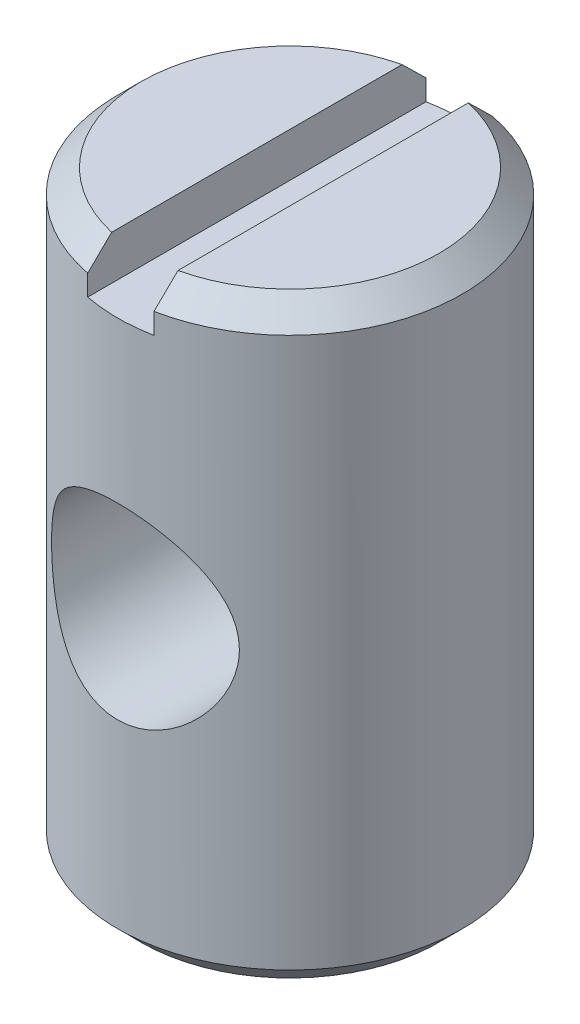
ISO-10303-21;
HEADER;
FILE_DESCRIPTION(('STEP AP214'),'2;1');
FILE_NAME('part.step','',(''),(''),'','','');
FILE_SCHEMA(('AUTOMOTIVE_DESIGN { 1 0 10303 214 1 1 1 1 }'));
ENDSEC;
DATA;
#1=APPLICATION_CONTEXT('core data for automotive mechanical design processes');
#2=APPLICATION_PROTOCOL_DEFINITION('international standard','automotive_design',2000,#1);
#3=PRODUCT_CONTEXT('',#1,'mechanical');
#4=PRODUCT('Part','Part','',(#3));
#5=PRODUCT_RELATED_PRODUCT_CATEGORY('part','',(#4));
#6=PRODUCT_DEFINITION_FORMATION('','',#4);
#7=PRODUCT_DEFINITION_CONTEXT('part definition',#1,'design');
#8=PRODUCT_DEFINITION('design','',#6,#7);
#9=PRODUCT_DEFINITION_SHAPE('','',#8);
#10=(LENGTH_UNIT() NAMED_UNIT(*) SI_UNIT(.MILLI.,.METRE.));
#11=(NAMED_UNIT(*) PLANE_ANGLE_UNIT() SI_UNIT($,.RADIAN.));
#12=(NAMED_UNIT(*) SI_UNIT($,.STERADIAN.) SOLID_ANGLE_UNIT());
#13=UNCERTAINTY_MEASURE_WITH_UNIT(LENGTH_MEASURE(1.E-05),#10,'distance_accuracy_value','');
#14=(GEOMETRIC_REPRESENTATION_CONTEXT(3) GLOBAL_UNCERTAINTY_ASSIGNED_CONTEXT((#13)) GLOBAL_UNIT_ASSIGNED_CONTEXT((#10,
#11,#12)) REPRESENTATION_CONTEXT('',''));
#15=CARTESIAN_POINT('',(0.,0.,0.));
#16=DIRECTION('',(0.,0.,1.));
#17=DIRECTION('',(1.,0.,0.));
#18=AXIS2_PLACEMENT_3D('',#15,#16,#17);
#19=CARTESIAN_POINT('',(0.,13.716,0.));
#20=DIRECTION('',(0.,1.,0.));
#21=DIRECTION('',(0.,0.,1.));
#22=AXIS2_PLACEMENT_3D('',#19,#20,#21);
#23=PLANE('',#22);
#24=DIRECTION('',(0.,0.,1.));
#25=VECTOR('',#24,1.);
#26=CARTESIAN_POINT('',(-0.762,13.716,-4.42144419335772));
#27=LINE('',#26,#25);
#28=CARTESIAN_POINT('',(-0.762,13.716,-3.33770695800352));
#29=VERTEX_POINT('',#28);
#30=CARTESIAN_POINT('',(-0.762000000000001,13.716,3.33770695800352));
#31=VERTEX_POINT('',#30);
#32=EDGE_CURVE('E175',#29,#31,#27,.T.);
#33=ORIENTED_EDGE('',*,*,#32,.F.);
#34=CARTESIAN_POINT('',(0.,13.716,0.));
#35=DIRECTION('',(0.,-1.,0.));
#36=DIRECTION('',(0.,0.,-1.));
#37=AXIS2_PLACEMENT_3D('',#34,#35,#36);
#38=CIRCLE('',#37,3.42358463273585);
#39=EDGE_CURVE('E177',#31,#29,#38,.T.);
#40=ORIENTED_EDGE('',*,*,#39,.F.);
#41=EDGE_LOOP('',(#33,#40));
#42=FACE_BOUND('',#41,.T.);
#43=ADVANCED_FACE('F36',(#42),#23,.T.);
#44=CARTESIAN_POINT('',(0.,13.1771846327359,0.));
#45=DIRECTION('',(0.,-1.,0.));
#46=DIRECTION('',(0.,0.,-1.));
#47=AXIS2_PLACEMENT_3D('',#44,#45,#46);
#48=CONICAL_SURFACE('',#47,3.9624,0.785398163397447);
#49=CARTESIAN_POINT('',(-0.762,13.1764846327358,-3.88915384241868));
#50=CARTESIAN_POINT('',(-0.762,13.2725234137536,-3.7912849415721));
#51=CARTESIAN_POINT('',(-0.762,13.3684979823827,-3.69335294588307));
#52=CARTESIAN_POINT('',(-0.762,13.5604084118547,-3.49718168791547));
#53=CARTESIAN_POINT('',(-0.762,13.6563440289932,-3.39894218726171));
#54=CARTESIAN_POINT('',(-0.762,13.8502900937675,-3.19989533596382));
#55=CARTESIAN_POINT('',(-0.762,13.9482952356119,-3.09908280950565));
#56=CARTESIAN_POINT('',(-0.762,14.1438570813751,-2.8972996653586));
#57=CARTESIAN_POINT('',(-0.762,14.2414142227925,-2.79632947111996));
#58=CARTESIAN_POINT('',(-0.762,14.5133697311457,-2.5137368754148));
#59=CARTESIAN_POINT('',(-0.762000000000001,14.6873234467839,-2.33168395017666));
#60=CARTESIAN_POINT('',(-0.762000000000001,14.9468511012226,-2.05629748590068));
#61=CARTESIAN_POINT('',(-0.762000000000001,15.0333679085639,-1.96385412397314));
#62=CARTESIAN_POINT('',(-0.762000000000001,15.2053779629451,-1.77813000147865));
#63=CARTESIAN_POINT('',(-0.762000000000001,15.2908718376705,-1.68484982314826));
#64=CARTESIAN_POINT('',(-0.762000000000001,15.4584876769228,-1.49901271998735));
#65=CARTESIAN_POINT('',(-0.762,15.5406423814312,-1.40648556184402));
#66=CARTESIAN_POINT('',(-0.762000000000001,15.6621455687927,-1.2659882807728));
#67=CARTESIAN_POINT('',(-0.762000000000001,15.7024084966591,-1.21881044932));
#68=CARTESIAN_POINT('',(-0.762000000000001,15.7820927608726,-1.1237508144509));
#69=CARTESIAN_POINT('',(-0.762000000000001,15.8215141426907,-1.07586904930722));
#70=CARTESIAN_POINT('',(-0.762000000000001,15.8987808161407,-0.979675108804961));
#71=CARTESIAN_POINT('',(-0.762000000000001,15.9366383504187,-0.931372808654795));
#72=CARTESIAN_POINT('',(-0.762000000000001,16.0107003383798,-0.833523176960325));
#73=CARTESIAN_POINT('',(-0.762000000000001,16.0469052157705,-0.783976169641534));
#74=CARTESIAN_POINT('',(-0.762000000000001,16.1166969489382,-0.683350700041306));
#75=CARTESIAN_POINT('',(-0.762000000000001,16.1502936183965,-0.632279090908778));
#76=CARTESIAN_POINT('',(-0.762000000000001,16.2135850348493,-0.527790782899455));
#77=CARTESIAN_POINT('',(-0.762000000000001,16.2432860456415,-0.474378037527284));
#78=CARTESIAN_POINT('',(-0.762000000000001,16.2754184608974,-0.407728077607535));
#79=CARTESIAN_POINT('',(-0.762000000000001,16.2809117834785,-0.395962527727781));
#80=CARTESIAN_POINT('',(-0.762000000000001,16.2915727529747,-0.372280120515825));
#81=CARTESIAN_POINT('',(-0.762000000000001,16.2967402884964,-0.360363213086689));
#82=CARTESIAN_POINT('',(-0.762000000000001,16.3116981051018,-0.32438809731012));
#83=CARTESIAN_POINT('',(-0.762000000000001,16.3209463304274,-0.300099899165241));
#84=CARTESIAN_POINT('',(-0.762000000000001,16.337548018884,-0.251272305994814));
#85=CARTESIAN_POINT('',(-0.762000000000001,16.3449270895583,-0.226741705767929));
#86=CARTESIAN_POINT('',(-0.762000000000001,16.3576333609885,-0.177138669407671));
#87=CARTESIAN_POINT('',(-0.762000000000001,16.3629599686638,-0.152066078867573));
#88=CARTESIAN_POINT('',(-0.762000000000001,16.3713470726516,-0.100962699246851));
#89=CARTESIAN_POINT('',(-0.762000000000001,16.3743544304069,-0.0749230078445896));
#90=CARTESIAN_POINT('',(-0.762000000000001,16.3776926558913,-0.022678992930157));
#91=CARTESIAN_POINT('',(-0.762000000000001,16.3780245309172,0.00352526490513808));
#92=CARTESIAN_POINT('',(-0.762000000000001,16.3759889298047,0.0558399532298979));
#93=CARTESIAN_POINT('',(-0.762000000000001,16.373620096976,0.0819503299462617));
#94=CARTESIAN_POINT('',(-0.762000000000001,16.366350506585,0.133819273652817));
#95=CARTESIAN_POINT('',(-0.762000000000001,16.3614486610262,0.159577684580384));
#96=CARTESIAN_POINT('',(-0.762000000000001,16.3479300988026,0.21685792012831));
#97=CARTESIAN_POINT('',(-0.762000000000001,16.3386949909186,0.248232486673333));
#98=CARTESIAN_POINT('',(-0.762000000000001,16.3174466249232,0.310017236700923));
#99=CARTESIAN_POINT('',(-0.762000000000001,16.3054321505824,0.340426991345254));
#100=CARTESIAN_POINT('',(-0.762000000000001,16.2791708285319,0.400504141876659));
#101=CARTESIAN_POINT('',(-0.762000000000001,16.2649091248219,0.430164953823593));
#102=CARTESIAN_POINT('',(-0.762000000000001,16.2347305423086,0.488611187050659));
#103=CARTESIAN_POINT('',(-0.762000000000001,16.2188141162323,0.51739684499919));
#104=CARTESIAN_POINT('',(-0.762000000000001,16.1678870204156,0.604877315343752));
#105=CARTESIAN_POINT('',(-0.762000000000001,16.130793651709,0.662352976226465));
#106=CARTESIAN_POINT('',(-0.762000000000001,16.0534027157473,0.775122384746781));
#107=CARTESIAN_POINT('',(-0.762000000000001,16.0131020126512,0.83041391592934));
#108=CARTESIAN_POINT('',(-0.762000000000001,15.9303688707398,0.93958917057718));
#109=CARTESIAN_POINT('',(-0.762000000000001,15.8879313262341,0.993469004298655));
#110=CARTESIAN_POINT('',(-0.762000000000001,15.8016939267619,1.10013129032849));
#111=CARTESIAN_POINT('',(-0.762000000000001,15.7578938729972,1.1529135806065));
#112=CARTESIAN_POINT('',(-0.762000000000001,15.6691464719561,1.25790855858688));
#113=CARTESIAN_POINT('',(-0.762000000000001,15.6241948608309,1.31011763088206));
#114=CARTESIAN_POINT('',(-0.762000000000001,15.5335954279645,1.41392912275435));
#115=CARTESIAN_POINT('',(-0.762000000000001,15.4879475849589,1.46553152371674));
#116=CARTESIAN_POINT('',(-0.762000000000001,15.3503935476947,1.61947598825091));
#117=CARTESIAN_POINT('',(-0.762000000000001,15.2577231601534,1.72113436354037));
#118=CARTESIAN_POINT('',(-0.762000000000001,15.082594065033,1.91094607118329));
#119=CARTESIAN_POINT('',(-0.762000000000001,15.000274587501,1.9992286930172));
#120=CARTESIAN_POINT('',(-0.762000000000001,14.8349863206549,2.17518689343137));
#121=CARTESIAN_POINT('',(-0.762000000000001,14.7520175193008,2.2628624606985));
#122=CARTESIAN_POINT('',(-0.762000000000001,14.5023198966647,2.52536452959782));
#123=CARTESIAN_POINT('',(-0.762000000000001,14.334912914799,2.69954505715497));
#124=CARTESIAN_POINT('',(-0.762000000000001,14.002593709442,3.04334452351151));
#125=CARTESIAN_POINT('',(-0.762000000000001,13.8377017703164,3.21298313678113));
#126=CARTESIAN_POINT('',(-0.762000000000001,13.5074190455435,3.5515162569994));
#127=CARTESIAN_POINT('',(-0.762000000000001,13.3420287493158,3.72041124114226));
#128=CARTESIAN_POINT('',(-0.762000000000001,13.1764846327358,3.88915384241868));
#129=B_SPLINE_CURVE_WITH_KNOTS('',3,(#49,#50,#51,#52,#53,#54,#55,#56,#57,#58,#59,#60,#61,#62,
#63,#64,#65,#66,#67,#68,#69,#70,#71,#72,#73,#74,#75,#76,#77,#78,#79,#80,#81,#82,#83,#84,#85,#86,
#87,#88,#89,#90,#91,#92,#93,#94,#95,#96,#97,#98,#99,#100,#101,#102,#103,#104,#105,#106,#107,
#108,#109,#110,#111,#112,#113,#114,#115,#116,#117,#118,#119,#120,#121,#122,#123,#124,#125,#126,
#127,#128),.UNSPECIFIED.,.F.,.F.,(4,2,2,2,2,2,2,2,2,2,2,2,2,2,2,2,2,2,2,2,2,2,2,2,2,2,2,2,2,2,2,
2,2,2,2,2,2,2,2,4),(0.,0.411358663586705,0.823295104655468,1.24509236639245,1.66629478319138,
2.42167845699793,2.80151363749427,3.18110237335076,3.5522808365199,3.73834307928575,
3.92439524305245,4.10848390822819,4.29252510864786,4.47583639536256,4.6588492265476,
4.69779924373798,4.73676250733111,4.8146703766901,4.89144484825009,4.96824148798541,
5.04674932484981,5.12522760278832,5.20374532136509,5.28229679346273,5.3802428750695,
5.47823189847825,5.57689821424319,5.67553760589328,5.88054052526118,6.08574640011215,
6.29146829178851,6.49722034160438,6.70389499445958,6.91057597232372,7.32323019523743,
7.68534994272209,8.04747642063783,8.77222689147921,9.48194344092483,10.1911064123325),.UNSPECIFIED.);
#130=CARTESIAN_POINT('',(-0.762,13.1771846327359,-3.88844053059835));
#131=VERTEX_POINT('',#130);
#132=EDGE_CURVE('E179',#131,#29,#129,.T.);
#133=ORIENTED_EDGE('',*,*,#132,.F.);
#134=CARTESIAN_POINT('',(0.,13.1771846327359,0.));
#135=DIRECTION('',(0.,-1.,0.));
#136=DIRECTION('',(0.,0.,-1.));
#137=AXIS2_PLACEMENT_3D('',#134,#135,#136);
#138=CIRCLE('',#137,3.9624);
#139=CARTESIAN_POINT('',(-0.762000000000001,13.1771846327359,3.88844053059835));
#140=VERTEX_POINT('',#139);
#141=EDGE_CURVE('E112',#140,#131,#138,.T.);
#142=ORIENTED_EDGE('',*,*,#141,.F.);
#143=EDGE_CURVE('E147',#31,#140,#129,.T.);
#144=ORIENTED_EDGE('',*,*,#143,.F.);
#145=ORIENTED_EDGE('',*,*,#39,.T.);
#146=EDGE_LOOP('',(#133,#142,#144,#145));
#147=FACE_BOUND('',#146,.T.);
#148=ADVANCED_FACE('F157',(#147),#48,.T.);
#149=DIRECTION('',(0.,0.,-1.));
#150=VECTOR('',#149,1.);
#151=CARTESIAN_POINT('',(0.762,13.716,-4.42144419335772));
#152=LINE('',#151,#150);
#153=CARTESIAN_POINT('',(0.762000000000001,13.716,3.33770695800352));
#154=VERTEX_POINT('',#153);
#155=CARTESIAN_POINT('',(0.762,13.716,-3.33770695800352));
#156=VERTEX_POINT('',#155);
#157=EDGE_CURVE('E106',#154,#156,#152,.T.);
#158=ORIENTED_EDGE('',*,*,#157,.F.);
#159=EDGE_CURVE('E180',#156,#154,#38,.T.);
#160=ORIENTED_EDGE('',*,*,#159,.F.);
#161=EDGE_LOOP('',(#158,#160));
#162=FACE_BOUND('',#161,.T.);
#163=ADVANCED_FACE('F38',(#162),#23,.T.);
#164=CARTESIAN_POINT('',(0.762000000000001,13.1764846327358,3.88915384241868));
#165=CARTESIAN_POINT('',(0.762000000000001,13.2725234137536,3.7912849415721));
#166=CARTESIAN_POINT('',(0.762000000000001,13.3684979823827,3.69335294588307));
#167=CARTESIAN_POINT('',(0.762000000000001,13.5604084118547,3.49718168791547));
#168=CARTESIAN_POINT('',(0.762000000000001,13.6563440289932,3.39894218726171));
#169=CARTESIAN_POINT('',(0.762000000000001,13.8502900937675,3.19989533596382));
#170=CARTESIAN_POINT('',(0.762000000000001,13.9482952356119,3.09908280950565));
#171=CARTESIAN_POINT('',(0.762000000000001,14.1438570813751,2.8972996653586));
#172=CARTESIAN_POINT('',(0.762000000000001,14.2414142227925,2.79632947111996));
#173=CARTESIAN_POINT('',(0.762000000000001,14.5133697311457,2.5137368754148));
#174=CARTESIAN_POINT('',(0.762000000000001,14.6873234467839,2.33168395017666));
#175=CARTESIAN_POINT('',(0.762000000000001,14.9468511012226,2.05629748590068));
#176=CARTESIAN_POINT('',(0.762000000000001,15.0333679085639,1.96385412397314));
#177=CARTESIAN_POINT('',(0.762000000000001,15.2053779629451,1.77813000147865));
#178=CARTESIAN_POINT('',(0.762000000000001,15.2908718376705,1.68484982314826));
#179=CARTESIAN_POINT('',(0.762000000000001,15.4584876769228,1.49901271998735));
#180=CARTESIAN_POINT('',(0.762000000000001,15.5406423814312,1.40648556184402));
#181=CARTESIAN_POINT('',(0.762000000000001,15.6621455687927,1.2659882807728));
#182=CARTESIAN_POINT('',(0.762000000000001,15.7024084966591,1.21881044932));
#183=CARTESIAN_POINT('',(0.762000000000001,15.7820927608726,1.1237508144509));
#184=CARTESIAN_POINT('',(0.762000000000001,15.8215141426907,1.07586904930722));
#185=CARTESIAN_POINT('',(0.762000000000001,15.8987808161407,0.979675108804963));
#186=CARTESIAN_POINT('',(0.762000000000001,15.9366383504187,0.931372808654796));
#187=CARTESIAN_POINT('',(0.762000000000001,16.0107003383798,0.833523176960326));
#188=CARTESIAN_POINT('',(0.762000000000001,16.0469052157705,0.783976169641535));
#189=CARTESIAN_POINT('',(0.762000000000001,16.1166969489382,0.683350700041306));
#190=CARTESIAN_POINT('',(0.762000000000001,16.1502936183965,0.632279090908778));
#191=CARTESIAN_POINT('',(0.762000000000001,16.2135850348493,0.527790782899455));
#192=CARTESIAN_POINT('',(0.762000000000001,16.2432860456415,0.474378037527284));
#193=CARTESIAN_POINT('',(0.762000000000001,16.2754184608974,0.407728077607535));
#194=CARTESIAN_POINT('',(0.762000000000001,16.2809117834785,0.395962527727781));
#195=CARTESIAN_POINT('',(0.762000000000001,16.2915727529747,0.372280120515825));
#196=CARTESIAN_POINT('',(0.762000000000001,16.2967402884964,0.360363213086689));
#197=CARTESIAN_POINT('',(0.762000000000001,16.3116981051018,0.324388097310119));
#198=CARTESIAN_POINT('',(0.762000000000001,16.3209463304274,0.30009989916524));
#199=CARTESIAN_POINT('',(0.762000000000001,16.337548018884,0.251272305994814));
#200=CARTESIAN_POINT('',(0.762000000000001,16.3449270895583,0.226741705767929));
#201=CARTESIAN_POINT('',(0.762000000000001,16.3576333609885,0.177138669407671));
#202=CARTESIAN_POINT('',(0.762000000000001,16.3629599686638,0.152066078867573));
#203=CARTESIAN_POINT('',(0.762000000000001,16.3713470726516,0.100962699246851));
#204=CARTESIAN_POINT('',(0.762000000000001,16.3743544304069,0.0749230078445894));
#205=CARTESIAN_POINT('',(0.762000000000001,16.3776926558913,0.0226789929301568));
#206=CARTESIAN_POINT('',(0.762000000000001,16.3780245309172,-0.00352526490513822));
#207=CARTESIAN_POINT('',(0.762000000000001,16.3759889298047,-0.0558399532298978));
#208=CARTESIAN_POINT('',(0.762000000000001,16.373620096976,-0.0819503299462613));
#209=CARTESIAN_POINT('',(0.762000000000001,16.366350506585,-0.133819273652817));
#210=CARTESIAN_POINT('',(0.762000000000001,16.3614486610262,-0.159577684580384));
#211=CARTESIAN_POINT('',(0.762000000000001,16.3479300988026,-0.21685792012831));
#212=CARTESIAN_POINT('',(0.762000000000001,16.3386949909186,-0.248232486673332));
#213=CARTESIAN_POINT('',(0.762000000000001,16.3174466249232,-0.310017236700923));
#214=CARTESIAN_POINT('',(0.762000000000001,16.3054321505824,-0.340426991345254));
#215=CARTESIAN_POINT('',(0.762000000000001,16.2791708285319,-0.40050414187666));
#216=CARTESIAN_POINT('',(0.762000000000001,16.2649091248219,-0.430164953823594));
#217=CARTESIAN_POINT('',(0.762000000000001,16.2347305423086,-0.488611187050659));
#218=CARTESIAN_POINT('',(0.762000000000001,16.2188141162323,-0.517396844999189));
#219=CARTESIAN_POINT('',(0.762000000000001,16.1678870204156,-0.604877315343751));
#220=CARTESIAN_POINT('',(0.762000000000001,16.130793651709,-0.662352976226462));
#221=CARTESIAN_POINT('',(0.762000000000001,16.0534027157473,-0.775122384746778));
#222=CARTESIAN_POINT('',(0.762000000000001,16.0131020126512,-0.830413915929337));
#223=CARTESIAN_POINT('',(0.762000000000001,15.9303688707398,-0.939589170577178));
#224=CARTESIAN_POINT('',(0.762000000000001,15.8879313262341,-0.993469004298654));
#225=CARTESIAN_POINT('',(0.762000000000001,15.8016939267619,-1.10013129032849));
#226=CARTESIAN_POINT('',(0.762000000000001,15.7578938729973,-1.1529135806065));
#227=CARTESIAN_POINT('',(0.762000000000001,15.6691464719562,-1.25790855858688));
#228=CARTESIAN_POINT('',(0.762000000000001,15.6241948608309,-1.31011763088206));
#229=CARTESIAN_POINT('',(0.762000000000001,15.5335954279645,-1.41392912275435));
#230=CARTESIAN_POINT('',(0.762000000000001,15.4879475849589,-1.46553152371674));
#231=CARTESIAN_POINT('',(0.762000000000001,15.3503935476947,-1.61947598825091));
#232=CARTESIAN_POINT('',(0.762000000000001,15.2577231601534,-1.72113436354037));
#233=CARTESIAN_POINT('',(0.762000000000001,15.082594065033,-1.91094607118328));
#234=CARTESIAN_POINT('',(0.762000000000001,15.000274587501,-1.9992286930172));
#235=CARTESIAN_POINT('',(0.762000000000001,14.8349863206549,-2.17518689343137));
#236=CARTESIAN_POINT('',(0.762,14.7520175193008,-2.2628624606985));
#237=CARTESIAN_POINT('',(0.762,14.5023198966647,-2.52536452959782));
#238=CARTESIAN_POINT('',(0.762,14.334912914799,-2.69954505715497));
#239=CARTESIAN_POINT('',(0.762,14.002593709442,-3.04334452351151));
#240=CARTESIAN_POINT('',(0.762,13.8377017703164,-3.21298313678113));
#241=CARTESIAN_POINT('',(0.762,13.5074190455435,-3.55151625699939));
#242=CARTESIAN_POINT('',(0.762,13.3420287493158,-3.72041124114226));
#243=CARTESIAN_POINT('',(0.762,13.1764846327358,-3.88915384241868));
#244=B_SPLINE_CURVE_WITH_KNOTS('',3,(#164,#165,#166,#167,#168,#169,#170,#171,#172,#173,#174,
#175,#176,#177,#178,#179,#180,#181,#182,#183,#184,#185,#186,#187,#188,#189,#190,#191,#192,#193,
#194,#195,#196,#197,#198,#199,#200,#201,#202,#203,#204,#205,#206,#207,#208,#209,#210,#211,#212,
#213,#214,#215,#216,#217,#218,#219,#220,#221,#222,#223,#224,#225,#226,#227,#228,#229,#230,#231,
#232,#233,#234,#235,#236,#237,#238,#239,#240,#241,#242,#243),.UNSPECIFIED.,.F.,.F.,(4,2,2,2,2,2,
2,2,2,2,2,2,2,2,2,2,2,2,2,2,2,2,2,2,2,2,2,2,2,2,2,2,2,2,2,2,2,2,2,4),(0.,0.411358663586705,
0.823295104655469,1.24509236639245,1.66629478319138,2.42167845699794,2.80151363749427,
3.18110237335076,3.5522808365199,3.73834307928575,3.92439524305245,4.10848390822819,
4.29252510864786,4.47583639536256,4.6588492265476,4.69779924373798,4.73676250733111,
4.8146703766901,4.89144484825009,4.96824148798542,5.04674932484981,5.12522760278832,
5.20374532136508,5.28229679346273,5.3802428750695,5.47823189847825,5.57689821424319,
5.67553760589328,5.88054052526118,6.08574640011215,6.29146829178851,6.49722034160438,
6.70389499445958,6.91057597232372,7.32323019523743,7.68534994272209,8.04747642063783,
8.77222689147921,9.48194344092483,10.1911064123325),.UNSPECIFIED.);
#245=CARTESIAN_POINT('',(0.762000000000001,13.1771846327359,3.88844053059835));
#246=VERTEX_POINT('',#245);
#247=EDGE_CURVE('E145',#246,#154,#244,.T.);
#248=ORIENTED_EDGE('',*,*,#247,.F.);
#249=CARTESIAN_POINT('',(0.762,13.1771846327359,-3.88844053059835));
#250=VERTEX_POINT('',#249);
#251=EDGE_CURVE('E181',#250,#246,#138,.T.);
#252=ORIENTED_EDGE('',*,*,#251,.F.);
#253=EDGE_CURVE('E138',#156,#250,#244,.T.);
#254=ORIENTED_EDGE('',*,*,#253,.F.);
#255=ORIENTED_EDGE('',*,*,#159,.T.);
#256=EDGE_LOOP('',(#248,#252,#254,#255));
#257=FACE_BOUND('',#256,.T.);
#258=ADVANCED_FACE('F153',(#257),#48,.T.);
#259=CARTESIAN_POINT('',(0.,0.,0.));
#260=DIRECTION('',(0.,-1.,0.));
#261=DIRECTION('',(0.,0.,-1.));
#262=AXIS2_PLACEMENT_3D('',#259,#260,#261);
#263=CYLINDRICAL_SURFACE('',#262,3.9624);
#264=CARTESIAN_POINT('',(0.,9.017,-3.9624));
#265=CARTESIAN_POINT('',(0.112242546144472,9.01699131432553,-3.96239240943324));
#266=CARTESIAN_POINT('',(0.2245861444206,9.00819547685096,-3.95758138257743));
#267=CARTESIAN_POINT('',(0.445871149462538,8.9734359092762,-3.93880653812431));
#268=CARTESIAN_POINT('',(0.554807487465608,8.94744776727653,-3.9248297059548));
#269=CARTESIAN_POINT('',(0.765760589702777,8.87966207593217,-3.88916768015029));
#270=CARTESIAN_POINT('',(0.867803719866992,8.83792932203938,-3.86751410116477));
#271=CARTESIAN_POINT('',(1.06324124091637,8.7402189610099,-3.81841592720982));
#272=CARTESIAN_POINT('',(1.15663536109644,8.68424090821542,-3.79097115106997));
#273=CARTESIAN_POINT('',(1.33926109331299,8.55534807837654,-3.73053107967804));
#274=CARTESIAN_POINT('',(1.4277783309556,8.48154074004449,-3.69728531100643));
#275=CARTESIAN_POINT('',(1.59185360919563,8.32103454092115,-3.62967026516628));
#276=CARTESIAN_POINT('',(1.66739977223414,8.23432399889108,-3.59529999221315));
#277=CARTESIAN_POINT('',(1.81072292527419,8.04056458270405,-3.52545629246179));
#278=CARTESIAN_POINT('',(1.87705256916511,7.93236148520075,-3.49019502104813));
#279=CARTESIAN_POINT('',(1.99032652537086,7.7041861049436,-3.42687328274529));
#280=CARTESIAN_POINT('',(2.03728607244864,7.58422316368693,-3.39880716340304));
#281=CARTESIAN_POINT('',(2.09023335870458,7.40196286104769,-3.36629195317351));
#282=CARTESIAN_POINT('',(2.10473796862245,7.34285738933262,-3.35721465723211));
#283=CARTESIAN_POINT('',(2.1287471100664,7.22327677499569,-3.34204344560993));
#284=CARTESIAN_POINT('',(2.13825455766308,7.16280245270046,-3.33594779015126));
#285=CARTESIAN_POINT('',(2.15209471111484,7.04107781543585,-3.32703639034022));
#286=CARTESIAN_POINT('',(2.15643214744841,6.97982826174069,-3.32421764772281));
#287=CARTESIAN_POINT('',(2.15987303314584,6.85714110018195,-3.32198161455269));
#288=CARTESIAN_POINT('',(2.15897717220029,6.79570351816502,-3.32256387578534));
#289=CARTESIAN_POINT('',(2.14948390224229,6.63027925062869,-3.32872564688208));
#290=CARTESIAN_POINT('',(2.13592974221056,6.52664391729863,-3.33752093203394));
#291=CARTESIAN_POINT('',(2.09437060990876,6.32351374121958,-3.36374864713965));
#292=CARTESIAN_POINT('',(2.06635930570396,6.22402073337575,-3.38118486151123));
#293=CARTESIAN_POINT('',(1.99630578368146,6.02914591247129,-3.42302029235244));
#294=CARTESIAN_POINT('',(1.9539700274707,5.93390165133409,-3.44756348874107));
#295=CARTESIAN_POINT('',(1.85671578412842,5.75138476515411,-3.50089883637572));
#296=CARTESIAN_POINT('',(1.80179181287756,5.66411563776436,-3.52969283755482));
#297=CARTESIAN_POINT('',(1.67107216566348,5.4858388218009,-3.59363340614745));
#298=CARTESIAN_POINT('',(1.59336329081294,5.39633410221413,-3.62907440518571));
#299=CARTESIAN_POINT('',(1.4240627416305,5.23093409510115,-3.69878989494452));
#300=CARTESIAN_POINT('',(1.33246196614071,5.15504780125486,-3.73306360276487));
#301=CARTESIAN_POINT('',(1.13058518822213,5.01432277184015,-3.79925980167088));
#302=CARTESIAN_POINT('',(1.01948444705296,4.95051617632702,-3.83088679501183));
#303=CARTESIAN_POINT('',(0.785984643158287,4.84306041007964,-3.88550721342125));
#304=CARTESIAN_POINT('',(0.663596165652958,4.79939258001855,-3.90850862670723));
#305=CARTESIAN_POINT('',(0.423055699238972,4.73755787954535,-3.94144543422628));
#306=CARTESIAN_POINT('',(0.305552757042455,4.71741175173818,-3.95238962103185));
#307=CARTESIAN_POINT('',(0.0683528323712017,4.69680737992057,-3.96358471508688));
#308=CARTESIAN_POINT('',(-0.0513427444618571,4.69633693574968,-3.96384224873215));
#309=CARTESIAN_POINT('',(-0.277303885499177,4.71417350801976,-3.95414792248497));
#310=CARTESIAN_POINT('',(-0.383759968417556,4.73069078749383,-3.94516913500534));
#311=CARTESIAN_POINT('',(-0.59211937733196,4.77903015575992,-3.91931524375721));
#312=CARTESIAN_POINT('',(-0.694022237665041,4.81085380605321,-3.90243933435728));
#313=CARTESIAN_POINT('',(-0.893214148599867,4.88945060060717,-3.86178256139163));
#314=CARTESIAN_POINT('',(-0.990340638949996,4.9365544121047,-3.83785014646261));
#315=CARTESIAN_POINT('',(-1.17557314087734,5.04394809657074,-3.78522485969292));
#316=CARTESIAN_POINT('',(-1.2636757653204,5.10424289437765,-3.75653021084661));
#317=CARTESIAN_POINT('',(-1.43874340776188,5.24393990056086,-3.69326710700851));
#318=CARTESIAN_POINT('',(-1.52450347260248,5.32471824075665,-3.6584000453044));
#319=CARTESIAN_POINT('',(-1.68189635719445,5.49920220257583,-3.58876872803737));
#320=CARTESIAN_POINT('',(-1.75351494590016,5.59292068680834,-3.5540046103654));
#321=CARTESIAN_POINT('',(-1.88580605517688,5.79917249266045,-3.48572736627169));
#322=CARTESIAN_POINT('',(-1.94526682366895,5.9125870820473,-3.45250002205897));
#323=CARTESIAN_POINT('',(-2.04367768153916,6.15009931066941,-3.39518401420682));
#324=CARTESIAN_POINT('',(-2.08265750914634,6.27418115455534,-3.37108211476231));
#325=CARTESIAN_POINT('',(-2.13511141177764,6.51677161923811,-3.33808228742221));
#326=CARTESIAN_POINT('',(-2.15070027854392,6.63464560113979,-3.32793195171913));
#327=CARTESIAN_POINT('',(-2.16220790011491,6.87171879216694,-3.32047222173503));
#328=CARTESIAN_POINT('',(-2.1581423817353,6.99091686561712,-3.32315256073817));
#329=CARTESIAN_POINT('',(-2.13250993124946,7.21053018070471,-3.33963764589562));
#330=CARTESIAN_POINT('',(-2.11331535675371,7.31135374234509,-3.3519327886451));
#331=CARTESIAN_POINT('',(-2.06130270467544,7.50813529016438,-3.38416542002782));
#332=CARTESIAN_POINT('',(-2.02847921651105,7.6040913269742,-3.40410594358178));
#333=CARTESIAN_POINT('',(-1.9479363188434,7.79514477427011,-3.45086166600508));
#334=CARTESIAN_POINT('',(-1.8994155315669,7.88981535796608,-3.47802807065245));
#335=CARTESIAN_POINT('',(-1.7896280720848,8.07030614159139,-3.53577348996969));
#336=CARTESIAN_POINT('',(-1.72835458853531,8.15612157510789,-3.56635432425836));
#337=CARTESIAN_POINT('',(-1.58386235829169,8.33018506937177,-3.63307602759659));
#338=CARTESIAN_POINT('',(-1.49872012710322,8.41679489888095,-3.66935146494798));
#339=CARTESIAN_POINT('',(-1.31447562970143,8.5750337993025,-3.7393180984474));
#340=CARTESIAN_POINT('',(-1.21536373855542,8.64665245620829,-3.77300748790939));
#341=CARTESIAN_POINT('',(-1.00160593652987,8.77477340873364,-3.83537658744772));
#342=CARTESIAN_POINT('',(-0.886570024398929,8.83073053566536,-3.86386581287025));
#343=CARTESIAN_POINT('',(-0.706920647946546,8.89899483022839,-3.8993112018783));
#344=CARTESIAN_POINT('',(-0.645892122268114,8.91913060185105,-3.9099075814892));
#345=CARTESIAN_POINT('',(-0.521911048927872,8.95395488702047,-3.92837608301541));
#346=CARTESIAN_POINT('',(-0.458959546594552,8.96864630501982,-3.93624965734205));
#347=CARTESIAN_POINT('',(-0.330391387377316,8.99259230002858,-3.9491407445406));
#348=CARTESIAN_POINT('',(-0.264746554566714,9.00172955020073,-3.95409655849612));
#349=CARTESIAN_POINT('',(-0.132746263918452,9.01393595530517,-3.96072842373921));
#350=CARTESIAN_POINT('',(-0.0663908092778158,9.01700513752563,-3.96240448977583));
#351=CARTESIAN_POINT('',(0.,9.017,-3.9624));
#352=B_SPLINE_CURVE_WITH_KNOTS('',3,(#264,#265,#266,#267,#268,#269,#270,#271,#272,#273,#274,
#275,#276,#277,#278,#279,#280,#281,#282,#283,#284,#285,#286,#287,#288,#289,#290,#291,#292,#293,
#294,#295,#296,#297,#298,#299,#300,#301,#302,#303,#304,#305,#306,#307,#308,#309,#310,#311,#312,
#313,#314,#315,#316,#317,#318,#319,#320,#321,#322,#323,#324,#325,#326,#327,#328,#329,#330,#331,
#332,#333,#334,#335,#336,#337,#338,#339,#340,#341,#342,#343,#344,#345,#346,#347,#348,#349,#350,
#351),.UNSPECIFIED.,.T.,.F.,(4,2,2,2,2,2,2,2,2,2,2,2,2,2,2,2,2,2,2,2,2,2,2,2,2,2,2,2,2,2,2,2,2,
2,2,2,2,2,2,2,2,2,2,4),(0.,0.336470062550721,0.673418918059839,1.00899595693735,
1.34458349548263,1.70298042669212,2.06170381019734,2.4549494770086,2.8478852599393,
3.03224292624814,3.21649289173038,3.40057414167938,3.58463113230677,3.89766046926167,
4.21082702318238,4.53084448687431,4.85100163369022,5.22058777041753,5.59041709270351,
5.98416898724702,6.37755531918575,6.73468761384255,7.09159846074615,7.41440942379479,
7.7372533258523,8.06761039981068,8.3980910232979,8.76514572314338,9.13256794079159,
9.5273421855647,9.9215416248037,10.2773389145065,10.6328515536457,10.9416024165485,
11.2504759687194,11.5786140524989,11.906927849992,12.2854952827603,12.6643248307817,
13.0550477301602,13.2501845519639,13.4452171218424,13.6442380900501,13.8432581632561),.UNSPECIFIED.);
#353=CARTESIAN_POINT('',(0.,9.017,-3.9624));
#354=VERTEX_POINT('',#353);
#355=EDGE_CURVE('E11',#354,#354,#352,.T.);
#356=ORIENTED_EDGE('',*,*,#355,.F.);
#357=EDGE_LOOP('',(#356));
#358=FACE_BOUND('',#357,.T.);
#359=CARTESIAN_POINT('',(2.159,6.858,3.32254913582929));
#360=CARTESIAN_POINT('',(2.15899009982912,6.96884509964673,3.32256226553342));
#361=CARTESIAN_POINT('',(2.15040371898715,7.0797970867572,3.32818422001346));
#362=CARTESIAN_POINT('',(2.11655525795951,7.29815854031264,3.3498032033459));
#363=CARTESIAN_POINT('',(2.09126439680797,7.40556155610455,3.36581813793839));
#364=CARTESIAN_POINT('',(2.02551131100083,7.61323625588526,3.40578529514091));
#365=CARTESIAN_POINT('',(1.98514212308484,7.71354727534802,3.42968874060867));
#366=CARTESIAN_POINT('',(1.89066403276821,7.90593654330623,3.48266119839855));
#367=CARTESIAN_POINT('',(1.8365524522648,7.99801318235984,3.5117312172451));
#368=CARTESIAN_POINT('',(1.70985800164272,8.18135995859602,3.57526187200707));
#369=CARTESIAN_POINT('',(1.63597643214724,8.27164685295567,3.6099712453475));
#370=CARTESIAN_POINT('',(1.47452338145531,8.43933476938151,3.67887269332113));
#371=CARTESIAN_POINT('',(1.38694391986475,8.51672822510272,3.71306445357591));
#372=CARTESIAN_POINT('',(1.19163981429118,8.66281389416092,3.78049460436833));
#373=CARTESIAN_POINT('',(1.08284198849358,8.73023330561185,3.81341294764105));
#374=CARTESIAN_POINT('',(0.853315260326715,8.84535464643197,3.87123084430156));
#375=CARTESIAN_POINT('',(0.732595365334939,8.89307132253659,3.89613639186249));
#376=CARTESIAN_POINT('',(0.493120773722915,8.96332210332985,3.93330686584563));
#377=CARTESIAN_POINT('',(0.37501540981882,8.98759912268045,3.9464402621888));
#378=CARTESIAN_POINT('',(0.135741569783029,9.0160868905753,3.96188335309478));
#379=CARTESIAN_POINT('',(0.0145754305297021,9.02031250889285,3.96420106835905));
#380=CARTESIAN_POINT('',(-0.213997910014801,9.00909723644651,3.95809857556895));
#381=CARTESIAN_POINT('',(-0.321538852518641,8.99563376648556,3.95075792893934));
#382=CARTESIAN_POINT('',(-0.532554322815272,8.95305436851895,3.92788280971382));
#383=CARTESIAN_POINT('',(-0.63602853873805,8.92393724256601,3.91234771001227));
#384=CARTESIAN_POINT('',(-0.837515218679806,8.85085499392004,3.87425138139864));
#385=CARTESIAN_POINT('',(-0.935453796581777,8.80672771049366,3.85161363643119));
#386=CARTESIAN_POINT('',(-1.12273275413064,8.70519011398184,3.80125008715644));
#387=CARTESIAN_POINT('',(-1.2120703262339,8.647775484312,3.7735226299901));
#388=CARTESIAN_POINT('',(-1.38979043887431,8.51431958379422,3.71198773790313));
#389=CARTESIAN_POINT('',(-1.47705692008675,8.43694544785163,3.67784726795716));
#390=CARTESIAN_POINT('',(-1.63803012092863,8.2692647051346,3.6090373757836));
#391=CARTESIAN_POINT('',(-1.71172308983258,8.17894514679742,3.57436745526812));
#392=CARTESIAN_POINT('',(-1.84970658615351,7.97866094562986,3.50508966520992));
#393=CARTESIAN_POINT('',(-1.912662836833,7.86767851489844,3.47073827669718));
#394=CARTESIAN_POINT('',(-2.01858196010574,7.63450133172481,3.41023326348029));
#395=CARTESIAN_POINT('',(-2.06156785493519,7.51231968558188,3.38407021051142));
#396=CARTESIAN_POINT('',(-2.12260460746905,7.27042206523844,3.34609778165942));
#397=CARTESIAN_POINT('',(-2.14239319445825,7.15130802634652,3.33329740148996));
#398=CARTESIAN_POINT('',(-2.16171197847945,6.91081729898817,3.32080912334294));
#399=CARTESIAN_POINT('',(-2.16126418585022,6.78944321236626,3.32110697890414));
#400=CARTESIAN_POINT('',(-2.14171443857646,6.56631029178665,3.33372927375746));
#401=CARTESIAN_POINT('',(-2.12525821613009,6.46420388989449,3.34434779171177));
#402=CARTESIAN_POINT('',(-2.07835028989872,6.26447674367614,3.37369735318895));
#403=CARTESIAN_POINT('',(-2.04789266051207,6.16685791781858,3.39243183131208));
#404=CARTESIAN_POINT('',(-1.97256807931069,5.97401059822737,3.43679599583608));
#405=CARTESIAN_POINT('',(-1.92713906239659,5.87906427161911,3.46268698948278));
#406=CARTESIAN_POINT('',(-1.82362807540859,5.6975736997443,3.51830154497774));
#407=CARTESIAN_POINT('',(-1.76553977944413,5.61103368651453,3.54802701988959));
#408=CARTESIAN_POINT('',(-1.62789103961316,5.43475867172163,3.61348115382881));
#409=CARTESIAN_POINT('',(-1.54639823940614,5.3466058322371,3.64942638803566));
#410=CARTESIAN_POINT('',(-1.36946504109373,5.18460762319719,3.71944030838636));
#411=CARTESIAN_POINT('',(-1.27401691281106,5.11077023637153,3.75350793998765));
#412=CARTESIAN_POINT('',(-1.0660024251845,4.97625396484694,3.81793766664868));
#413=CARTESIAN_POINT('',(-0.952836749692798,4.91637061282787,3.84804553840407));
#414=CARTESIAN_POINT('',(-0.715934092037655,4.81712666113839,3.89906095552936));
#415=CARTESIAN_POINT('',(-0.592208093997758,4.77774503259518,3.9199779246731));
#416=CARTESIAN_POINT('',(-0.351152448047951,4.72454334401398,3.94848377764811));
#417=CARTESIAN_POINT('',(-0.234438349099279,4.70854381706838,3.957205155493));
#418=CARTESIAN_POINT('',(0.000326893506416679,4.6958073282339,3.96413607521335));
#419=CARTESIAN_POINT('',(0.118377331510639,4.69906063383217,3.96235092825202));
#420=CARTESIAN_POINT('',(0.341577233528004,4.72349485747575,3.94909608518781));
#421=CARTESIAN_POINT('',(0.446957234707185,4.74309552022753,3.93848025627141));
#422=CARTESIAN_POINT('',(0.652684879145088,4.79727144721339,3.90965597234894));
#423=CARTESIAN_POINT('',(0.753031909363887,4.83184853072845,3.89144659491628));
#424=CARTESIAN_POINT('',(0.949916038136739,4.91614106351204,3.84821981721692));
#425=CARTESIAN_POINT('',(1.04619315963857,4.96634832935796,3.82298455879278));
#426=CARTESIAN_POINT('',(1.22928308860086,5.07986532050278,3.7681064628261));
#427=CARTESIAN_POINT('',(1.31609196136326,5.14318046157421,3.73846180488458));
#428=CARTESIAN_POINT('',(1.48824607490228,5.28938252753791,3.6735716574129));
#429=CARTESIAN_POINT('',(1.57230432901499,5.37367583857694,3.6380725008086));
#430=CARTESIAN_POINT('',(1.72570289736152,5.55516209097921,3.56786972787248));
#431=CARTESIAN_POINT('',(1.79502578926069,5.65237008384746,3.53316709606007));
#432=CARTESIAN_POINT('',(1.92110757298677,5.86464684682135,3.46632062109958));
#433=CARTESIAN_POINT('',(1.97681078819995,5.9804520983265,3.43447214052296));
#434=CARTESIAN_POINT('',(2.0445628520329,6.16143882580451,3.39426904911586));
#435=CARTESIAN_POINT('',(2.06450300888286,6.22292652210722,3.38213660222167));
#436=CARTESIAN_POINT('',(2.09887809598845,6.34791768699742,3.36091262034965));
#437=CARTESIAN_POINT('',(2.11331658082083,6.41141982524238,3.35181912240513));
#438=CARTESIAN_POINT('',(2.13617164173148,6.53843656519811,3.33729926899977));
#439=CARTESIAN_POINT('',(2.14471529851034,6.60191932467197,3.33179567519702));
#440=CARTESIAN_POINT('',(2.15613234828801,6.729589428298,3.32441680330889));
#441=CARTESIAN_POINT('',(2.15900573612116,6.79377677309199,3.32254152852893));
#442=CARTESIAN_POINT('',(2.159,6.858,3.32254913582929));
#443=B_SPLINE_CURVE_WITH_KNOTS('',3,(#359,#360,#361,#362,#363,#364,#365,#366,#367,#368,#369,
#370,#371,#372,#373,#374,#375,#376,#377,#378,#379,#380,#381,#382,#383,#384,#385,#386,#387,#388,
#389,#390,#391,#392,#393,#394,#395,#396,#397,#398,#399,#400,#401,#402,#403,#404,#405,#406,#407,
#408,#409,#410,#411,#412,#413,#414,#415,#416,#417,#418,#419,#420,#421,#422,#423,#424,#425,#426,
#427,#428,#429,#430,#431,#432,#433,#434,#435,#436,#437,#438,#439,#440,#441,#442),.UNSPECIFIED.,
.T.,.F.,(4,2,2,2,2,2,2,2,2,2,2,2,2,2,2,2,2,2,2,2,2,2,2,2,2,2,2,2,2,2,2,2,2,2,2,2,2,2,2,2,2,4),
(0.,0.332271907117287,0.665117800364903,0.995943002419846,1.32683272487404,1.69049714181679,
2.05437422437923,2.44874667241755,2.84282341053379,3.20461330617776,3.56613486269872,
3.89048509251845,4.21486014783592,4.54285713645719,4.87096082953693,5.23402495519992,
5.597454886084,5.99182005249887,6.38572945156405,6.74773171292871,7.10934024771837,
7.41983503911746,7.73046135763397,8.05441248381528,8.3785258623284,8.75285296428707,
9.12738820576228,9.51978638037889,9.91178127032861,10.264196242318,10.616433079991,
10.9381028583318,11.259811722908,11.5928900471522,11.9261062647938,12.2971829693991,
12.6686960051487,13.0634222013838,13.260456625206,13.4573635302775,13.6498804274018,
13.8423974999107),.UNSPECIFIED.);
#444=CARTESIAN_POINT('',(2.159,6.858,3.32254913582929));
#445=VERTEX_POINT('',#444);
#446=EDGE_CURVE('E49',#445,#445,#443,.T.);
#447=ORIENTED_EDGE('',*,*,#446,.F.);
#448=EDGE_LOOP('',(#447));
#449=FACE_BOUND('',#448,.T.);
#450=DIRECTION('',(0.,-1.,0.));
#451=VECTOR('',#450,1.);
#452=CARTESIAN_POINT('',(-0.762,0.,-3.88844053059835));
#453=LINE('',#452,#451);
#454=CARTESIAN_POINT('',(-0.762,12.7,-3.88844053059835));
#455=VERTEX_POINT('',#454);
#456=EDGE_CURVE('E63',#455,#131,#453,.F.);
#457=ORIENTED_EDGE('',*,*,#456,.F.);
#458=CARTESIAN_POINT('',(0.,12.7,0.));
#459=DIRECTION('',(0.,1.,0.));
#460=DIRECTION('',(0.,0.,1.));
#461=AXIS2_PLACEMENT_3D('',#458,#459,#460);
#462=CIRCLE('',#461,3.9624);
#463=CARTESIAN_POINT('',(0.762,12.7,-3.88844053059835));
#464=VERTEX_POINT('',#463);
#465=EDGE_CURVE('E93',#455,#464,#462,.F.);
#466=ORIENTED_EDGE('',*,*,#465,.T.);
#467=DIRECTION('',(0.,-1.,0.));
#468=VECTOR('',#467,1.);
#469=CARTESIAN_POINT('',(0.762,0.,-3.88844053059835));
#470=LINE('',#469,#468);
#471=EDGE_CURVE('E99',#250,#464,#470,.T.);
#472=ORIENTED_EDGE('',*,*,#471,.F.);
#473=ORIENTED_EDGE('',*,*,#251,.T.);
#474=DIRECTION('',(0.,-1.,0.));
#475=VECTOR('',#474,1.);
#476=CARTESIAN_POINT('',(0.762000000000001,0.,3.88844053059835));
#477=LINE('',#476,#475);
#478=CARTESIAN_POINT('',(0.762000000000001,12.7,3.88844053059835));
#479=VERTEX_POINT('',#478);
#480=EDGE_CURVE('E188',#479,#246,#477,.F.);
#481=ORIENTED_EDGE('',*,*,#480,.F.);
#482=CARTESIAN_POINT('',(-0.762000000000001,12.7,3.88844053059835));
#483=VERTEX_POINT('',#482);
#484=EDGE_CURVE('E102',#479,#483,#462,.F.);
#485=ORIENTED_EDGE('',*,*,#484,.T.);
#486=DIRECTION('',(0.,-1.,0.));
#487=VECTOR('',#486,1.);
#488=CARTESIAN_POINT('',(-0.762000000000001,0.,3.88844053059835));
#489=LINE('',#488,#487);
#490=EDGE_CURVE('E100',#140,#483,#489,.T.);
#491=ORIENTED_EDGE('',*,*,#490,.F.);
#492=ORIENTED_EDGE('',*,*,#141,.T.);
#493=EDGE_LOOP('',(#457,#466,#472,#473,#481,#485,#491,#492));
#494=FACE_BOUND('',#493,.T.);
#495=CARTESIAN_POINT('',(0.,0.53881536726415,0.));
#496=DIRECTION('',(0.,-1.,0.));
#497=DIRECTION('',(0.,0.,-1.));
#498=AXIS2_PLACEMENT_3D('',#495,#496,#497);
#499=CIRCLE('',#498,3.9624);
#500=CARTESIAN_POINT('',(0.,0.53881536726415,-3.9624));
#501=VERTEX_POINT('',#500);
#502=EDGE_CURVE('E196',#501,#501,#499,.T.);
#503=ORIENTED_EDGE('',*,*,#502,.F.);
#504=EDGE_LOOP('',(#503));
#505=FACE_BOUND('',#504,.T.);
#506=ADVANCED_FACE('F109',(#358,#449,#494,#505),#263,.T.);
#507=CARTESIAN_POINT('',(0.,0.,0.));
#508=DIRECTION('',(0.,1.,0.));
#509=DIRECTION('',(0.,0.,1.));
#510=AXIS2_PLACEMENT_3D('',#507,#508,#509);
#511=CONICAL_SURFACE('',#510,3.42358463273585,0.785398163397447);
#512=ORIENTED_EDGE('',*,*,#502,.T.);
#513=EDGE_LOOP('',(#512));
#514=FACE_BOUND('',#513,.T.);
#515=CARTESIAN_POINT('',(0.,0.,0.));
#516=DIRECTION('',(0.,-1.,0.));
#517=DIRECTION('',(0.,0.,-1.));
#518=AXIS2_PLACEMENT_3D('',#515,#516,#517);
#519=CIRCLE('',#518,3.42358463273585);
#520=CARTESIAN_POINT('',(0.,0.,-3.42358463273585));
#521=VERTEX_POINT('',#520);
#522=EDGE_CURVE('E194',#521,#521,#519,.T.);
#523=ORIENTED_EDGE('',*,*,#522,.F.);
#524=EDGE_LOOP('',(#523));
#525=FACE_BOUND('',#524,.T.);
#526=ADVANCED_FACE('F163',(#514,#525),#511,.T.);
#527=CARTESIAN_POINT('',(0.,0.,0.));
#528=DIRECTION('',(0.,-1.,0.));
#529=DIRECTION('',(0.,0.,-1.));
#530=AXIS2_PLACEMENT_3D('',#527,#528,#529);
#531=PLANE('',#530);
#532=ORIENTED_EDGE('',*,*,#522,.T.);
#533=EDGE_LOOP('',(#532));
#534=FACE_BOUND('',#533,.T.);
#535=ADVANCED_FACE('F204',(#534),#531,.T.);
#536=CARTESIAN_POINT('',(-0.762,12.7,-4.42144419335772));
#537=DIRECTION('',(-1.,0.,0.));
#538=DIRECTION('',(0.,0.,1.));
#539=AXIS2_PLACEMENT_3D('',#536,#537,#538);
#540=PLANE('',#539);
#541=ORIENTED_EDGE('',*,*,#132,.T.);
#542=ORIENTED_EDGE('',*,*,#32,.T.);
#543=ORIENTED_EDGE('',*,*,#143,.T.);
#544=ORIENTED_EDGE('',*,*,#490,.T.);
#545=DIRECTION('',(0.,0.,1.));
#546=VECTOR('',#545,1.);
#547=CARTESIAN_POINT('',(-0.762,12.7,-4.42144419335772));
#548=LINE('',#547,#546);
#549=EDGE_CURVE('E56',#455,#483,#548,.T.);
#550=ORIENTED_EDGE('',*,*,#549,.F.);
#551=ORIENTED_EDGE('',*,*,#456,.T.);
#552=EDGE_LOOP('',(#541,#542,#543,#544,#550,#551));
#553=FACE_BOUND('',#552,.T.);
#554=ADVANCED_FACE('F103',(#553),#540,.F.);
#555=CARTESIAN_POINT('',(0.762,12.7,-4.42144419335772));
#556=DIRECTION('',(1.,0.,0.));
#557=DIRECTION('',(0.,0.,-1.));
#558=AXIS2_PLACEMENT_3D('',#555,#556,#557);
#559=PLANE('',#558);
#560=ORIENTED_EDGE('',*,*,#247,.T.);
#561=ORIENTED_EDGE('',*,*,#157,.T.);
#562=ORIENTED_EDGE('',*,*,#253,.T.);
#563=ORIENTED_EDGE('',*,*,#471,.T.);
#564=DIRECTION('',(0.,0.,-1.));
#565=VECTOR('',#564,1.);
#566=CARTESIAN_POINT('',(0.762,12.7,-4.42144419335772));
#567=LINE('',#566,#565);
#568=EDGE_CURVE('E96',#479,#464,#567,.T.);
#569=ORIENTED_EDGE('',*,*,#568,.F.);
#570=ORIENTED_EDGE('',*,*,#480,.T.);
#571=EDGE_LOOP('',(#560,#561,#562,#563,#569,#570));
#572=FACE_BOUND('',#571,.T.);
#573=ADVANCED_FACE('F130',(#572),#559,.F.);
#574=CARTESIAN_POINT('',(0.,12.7,0.));
#575=DIRECTION('',(0.,1.,0.));
#576=DIRECTION('',(0.,0.,1.));
#577=AXIS2_PLACEMENT_3D('',#574,#575,#576);
#578=PLANE('',#577);
#579=ORIENTED_EDGE('',*,*,#549,.T.);
#580=ORIENTED_EDGE('',*,*,#484,.F.);
#581=ORIENTED_EDGE('',*,*,#568,.T.);
#582=ORIENTED_EDGE('',*,*,#465,.F.);
#583=EDGE_LOOP('',(#579,#580,#581,#582));
#584=FACE_BOUND('',#583,.T.);
#585=ADVANCED_FACE('F94',(#584),#578,.T.);
#586=CARTESIAN_POINT('',(0.,6.858,-3.9624));
#587=DIRECTION('',(0.,0.,1.));
#588=DIRECTION('',(1.,0.,0.));
#589=AXIS2_PLACEMENT_3D('',#586,#587,#588);
#590=CYLINDRICAL_SURFACE('',#589,2.159);
#591=ORIENTED_EDGE('',*,*,#355,.T.);
#592=EDGE_LOOP('',(#591));
#593=FACE_BOUND('',#592,.T.);
#594=ORIENTED_EDGE('',*,*,#446,.T.);
#595=EDGE_LOOP('',(#594));
#596=FACE_BOUND('',#595,.T.);
#597=ADVANCED_FACE('F122',(#593,#596),#590,.F.);
#598=CLOSED_SHELL('',(#43,#148,#163,#258,#506,#526,#535,#554,#573,#585,#597));
#599=MANIFOLD_SOLID_BREP('B2',#598);
#600=ADVANCED_BREP_SHAPE_REPRESENTATION('',(#18,#599),#14);
#601=SHAPE_DEFINITION_REPRESENTATION(#9,#600);
ENDSEC;
END-ISO-10303-21;
